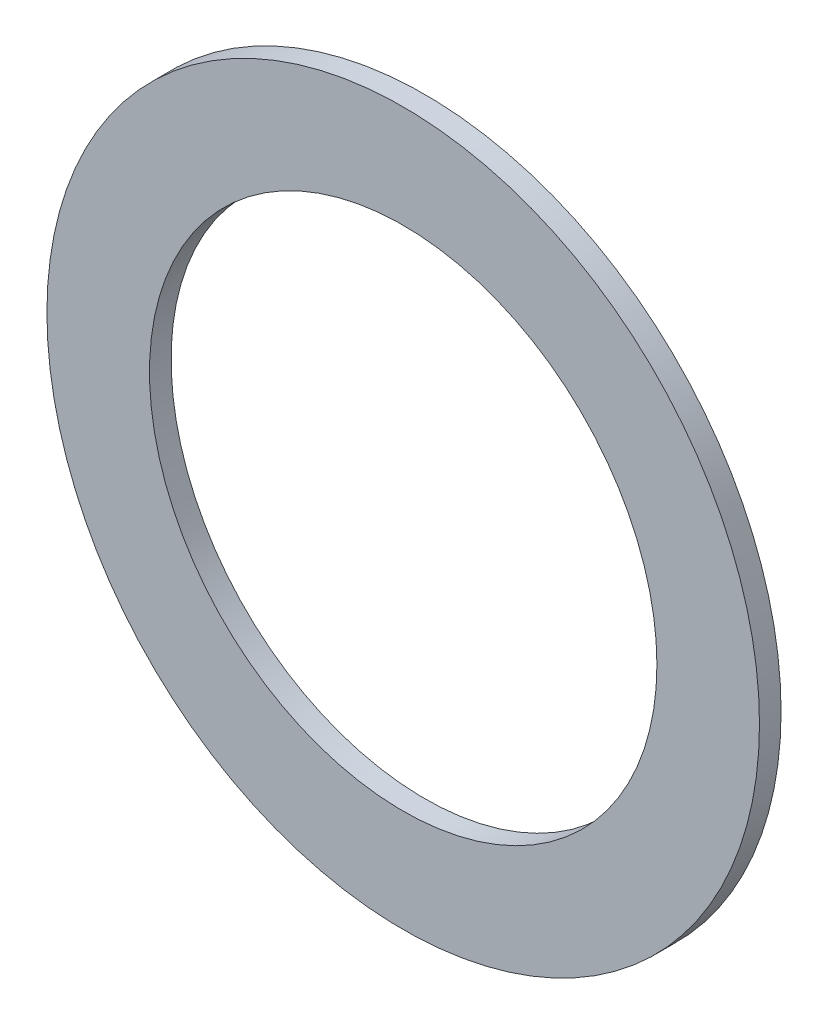
ISO-10303-21;
HEADER;
FILE_DESCRIPTION(('STEP AP214'),'2;1');
FILE_NAME('part.step','',(''),(''),'','','');
FILE_SCHEMA(('AUTOMOTIVE_DESIGN { 1 0 10303 214 1 1 1 1 }'));
ENDSEC;
DATA;
#1=APPLICATION_CONTEXT('core data for automotive mechanical design processes');
#2=APPLICATION_PROTOCOL_DEFINITION('international standard','automotive_design',2000,#1);
#3=PRODUCT_CONTEXT('',#1,'mechanical');
#4=PRODUCT('Part','Part','',(#3));
#5=PRODUCT_RELATED_PRODUCT_CATEGORY('part','',(#4));
#6=PRODUCT_DEFINITION_FORMATION('','',#4);
#7=PRODUCT_DEFINITION_CONTEXT('part definition',#1,'design');
#8=PRODUCT_DEFINITION('design','',#6,#7);
#9=PRODUCT_DEFINITION_SHAPE('','',#8);
#10=(LENGTH_UNIT() NAMED_UNIT(*) SI_UNIT(.MILLI.,.METRE.));
#11=(NAMED_UNIT(*) PLANE_ANGLE_UNIT() SI_UNIT($,.RADIAN.));
#12=(NAMED_UNIT(*) SI_UNIT($,.STERADIAN.) SOLID_ANGLE_UNIT());
#13=UNCERTAINTY_MEASURE_WITH_UNIT(LENGTH_MEASURE(1.E-05),#10,'distance_accuracy_value','');
#14=(GEOMETRIC_REPRESENTATION_CONTEXT(3) GLOBAL_UNCERTAINTY_ASSIGNED_CONTEXT((#13)) GLOBAL_UNIT_ASSIGNED_CONTEXT((#10,
#11,#12)) REPRESENTATION_CONTEXT('',''));
#15=CARTESIAN_POINT('',(0.,0.,0.));
#16=DIRECTION('',(0.,0.,1.));
#17=DIRECTION('',(1.,0.,0.));
#18=AXIS2_PLACEMENT_3D('',#15,#16,#17);
#19=CARTESIAN_POINT('',(0.,0.,0.508));
#20=DIRECTION('',(0.,0.,1.));
#21=DIRECTION('',(1.,0.,0.));
#22=AXIS2_PLACEMENT_3D('',#19,#20,#21);
#23=PLANE('',#22);
#24=CARTESIAN_POINT('',(0.,0.,0.508));
#25=DIRECTION('',(0.,0.,1.));
#26=DIRECTION('',(1.,0.,0.));
#27=AXIS2_PLACEMENT_3D('',#24,#25,#26);
#28=CIRCLE('',#27,8.382);
#29=CARTESIAN_POINT('',(8.382,0.,0.508));
#30=VERTEX_POINT('',#29);
#31=EDGE_CURVE('E10',#30,#30,#28,.T.);
#32=ORIENTED_EDGE('',*,*,#31,.T.);
#33=EDGE_LOOP('',(#32));
#34=FACE_BOUND('',#33,.T.);
#35=CARTESIAN_POINT('',(0.,0.,0.508));
#36=DIRECTION('',(0.,0.,1.));
#37=DIRECTION('',(1.,0.,0.));
#38=AXIS2_PLACEMENT_3D('',#35,#36,#37);
#39=CIRCLE('',#38,5.969);
#40=CARTESIAN_POINT('',(5.969,0.,0.508));
#41=VERTEX_POINT('',#40);
#42=EDGE_CURVE('E52',#41,#41,#39,.T.);
#43=ORIENTED_EDGE('',*,*,#42,.F.);
#44=EDGE_LOOP('',(#43));
#45=FACE_BOUND('',#44,.T.);
#46=ADVANCED_FACE('F41',(#34,#45),#23,.T.);
#47=CARTESIAN_POINT('',(0.,0.,0.));
#48=DIRECTION('',(0.,0.,1.));
#49=DIRECTION('',(1.,0.,0.));
#50=AXIS2_PLACEMENT_3D('',#47,#48,#49);
#51=PLANE('',#50);
#52=CARTESIAN_POINT('',(0.,0.,0.));
#53=DIRECTION('',(0.,0.,1.));
#54=DIRECTION('',(1.,0.,0.));
#55=AXIS2_PLACEMENT_3D('',#52,#53,#54);
#56=CIRCLE('',#55,8.382);
#57=CARTESIAN_POINT('',(8.382,0.,0.));
#58=VERTEX_POINT('',#57);
#59=EDGE_CURVE('E45',#58,#58,#56,.T.);
#60=ORIENTED_EDGE('',*,*,#59,.F.);
#61=EDGE_LOOP('',(#60));
#62=FACE_BOUND('',#61,.T.);
#63=CARTESIAN_POINT('',(0.,0.,0.));
#64=DIRECTION('',(0.,0.,1.));
#65=DIRECTION('',(1.,0.,0.));
#66=AXIS2_PLACEMENT_3D('',#63,#64,#65);
#67=CIRCLE('',#66,5.969);
#68=CARTESIAN_POINT('',(5.969,0.,0.));
#69=VERTEX_POINT('',#68);
#70=EDGE_CURVE('E54',#69,#69,#67,.T.);
#71=ORIENTED_EDGE('',*,*,#70,.T.);
#72=EDGE_LOOP('',(#71));
#73=FACE_BOUND('',#72,.T.);
#74=ADVANCED_FACE('F64',(#62,#73),#51,.F.);
#75=CARTESIAN_POINT('',(0.,0.,0.508));
#76=DIRECTION('',(0.,0.,-1.));
#77=DIRECTION('',(-1.,0.,0.));
#78=AXIS2_PLACEMENT_3D('',#75,#76,#77);
#79=CYLINDRICAL_SURFACE('',#78,8.382);
#80=ORIENTED_EDGE('',*,*,#31,.F.);
#81=EDGE_LOOP('',(#80));
#82=FACE_BOUND('',#81,.T.);
#83=ORIENTED_EDGE('',*,*,#59,.T.);
#84=EDGE_LOOP('',(#83));
#85=FACE_BOUND('',#84,.T.);
#86=ADVANCED_FACE('F43',(#82,#85),#79,.T.);
#87=CARTESIAN_POINT('',(0.,0.,0.508));
#88=DIRECTION('',(0.,0.,-1.));
#89=DIRECTION('',(-1.,0.,0.));
#90=AXIS2_PLACEMENT_3D('',#87,#88,#89);
#91=CYLINDRICAL_SURFACE('',#90,5.969);
#92=ORIENTED_EDGE('',*,*,#42,.T.);
#93=EDGE_LOOP('',(#92));
#94=FACE_BOUND('',#93,.T.);
#95=ORIENTED_EDGE('',*,*,#70,.F.);
#96=EDGE_LOOP('',(#95));
#97=FACE_BOUND('',#96,.T.);
#98=ADVANCED_FACE('F60',(#94,#97),#91,.F.);
#99=CLOSED_SHELL('',(#46,#74,#86,#98));
#100=MANIFOLD_SOLID_BREP('B2',#99);
#101=ADVANCED_BREP_SHAPE_REPRESENTATION('',(#18,#100),#14);
#102=SHAPE_DEFINITION_REPRESENTATION(#9,#101);
ENDSEC;
END-ISO-10303-21;
